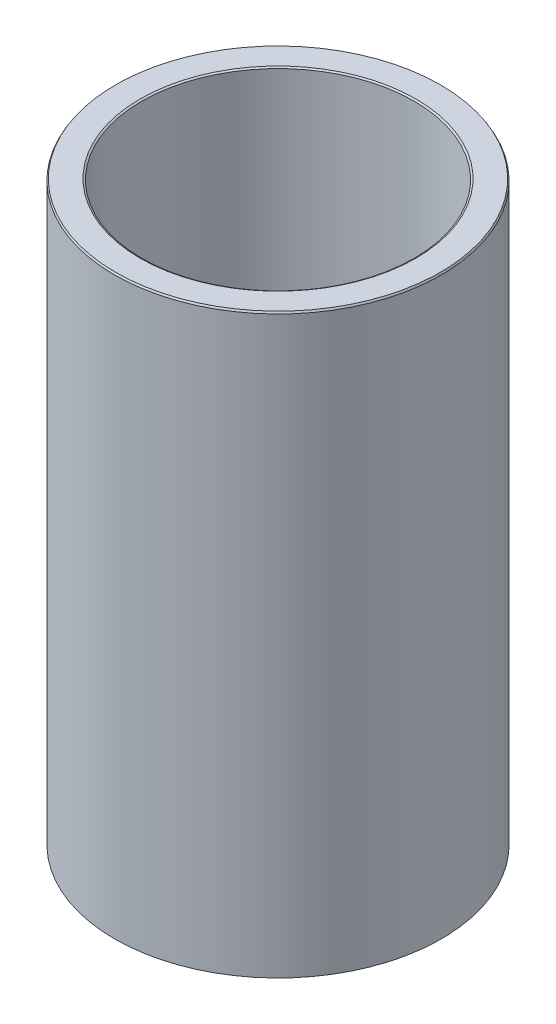
ISO-10303-21;
HEADER;
FILE_DESCRIPTION(('STEP AP214'),'2;1');
FILE_NAME('part.step','',(''),(''),'','','');
FILE_SCHEMA(('AUTOMOTIVE_DESIGN { 1 0 10303 214 1 1 1 1 }'));
ENDSEC;
DATA;
#1=APPLICATION_CONTEXT('core data for automotive mechanical design processes');
#2=APPLICATION_PROTOCOL_DEFINITION('international standard','automotive_design',2000,#1);
#3=PRODUCT_CONTEXT('',#1,'mechanical');
#4=PRODUCT('Part','Part','',(#3));
#5=PRODUCT_RELATED_PRODUCT_CATEGORY('part','',(#4));
#6=PRODUCT_DEFINITION_FORMATION('','',#4);
#7=PRODUCT_DEFINITION_CONTEXT('part definition',#1,'design');
#8=PRODUCT_DEFINITION('design','',#6,#7);
#9=PRODUCT_DEFINITION_SHAPE('','',#8);
#10=(LENGTH_UNIT() NAMED_UNIT(*) SI_UNIT(.MILLI.,.METRE.));
#11=(NAMED_UNIT(*) PLANE_ANGLE_UNIT() SI_UNIT($,.RADIAN.));
#12=(NAMED_UNIT(*) SI_UNIT($,.STERADIAN.) SOLID_ANGLE_UNIT());
#13=UNCERTAINTY_MEASURE_WITH_UNIT(LENGTH_MEASURE(1.E-05),#10,'distance_accuracy_value','');
#14=(GEOMETRIC_REPRESENTATION_CONTEXT(3) GLOBAL_UNCERTAINTY_ASSIGNED_CONTEXT((#13)) GLOBAL_UNIT_ASSIGNED_CONTEXT((#10,
#11,#12)) REPRESENTATION_CONTEXT('',''));
#15=CARTESIAN_POINT('',(0.,0.,0.));
#16=DIRECTION('',(0.,0.,1.));
#17=DIRECTION('',(1.,0.,0.));
#18=AXIS2_PLACEMENT_3D('',#15,#16,#17);
#19=CARTESIAN_POINT('',(0.,159.111934385555,0.));
#20=DIRECTION('',(0.,-1.,0.));
#21=DIRECTION('',(0.,0.,-1.));
#22=AXIS2_PLACEMENT_3D('',#19,#20,#21);
#23=CYLINDRICAL_SURFACE('',#22,45.);
#24=CARTESIAN_POINT('',(0.,0.278200347624352,0.));
#25=DIRECTION('',(0.,1.,0.));
#26=DIRECTION('',(0.,0.,1.));
#27=AXIS2_PLACEMENT_3D('',#24,#25,#26);
#28=CIRCLE('',#27,45.);
#29=CARTESIAN_POINT('',(0.,0.278200347624352,45.));
#30=VERTEX_POINT('',#29);
#31=EDGE_CURVE('E10',#30,#30,#28,.T.);
#32=ORIENTED_EDGE('',*,*,#31,.T.);
#33=EDGE_LOOP('',(#32));
#34=FACE_BOUND('',#33,.T.);
#35=CARTESIAN_POINT('',(0.,158.630077248787,0.));
#36=DIRECTION('',(0.,1.,0.));
#37=DIRECTION('',(0.,0.,1.));
#38=AXIS2_PLACEMENT_3D('',#35,#36,#37);
#39=CIRCLE('',#38,45.);
#40=CARTESIAN_POINT('',(0.,158.630077248787,45.));
#41=VERTEX_POINT('',#40);
#42=EDGE_CURVE('E50',#41,#41,#39,.F.);
#43=ORIENTED_EDGE('',*,*,#42,.T.);
#44=EDGE_LOOP('',(#43));
#45=FACE_BOUND('',#44,.T.);
#46=ADVANCED_FACE('F39',(#34,#45),#23,.T.);
#47=CARTESIAN_POINT('',(0.,159.111934385555,0.));
#48=DIRECTION('',(0.,1.,0.));
#49=DIRECTION('',(0.,0.,1.));
#50=AXIS2_PLACEMENT_3D('',#47,#48,#49);
#51=PLANE('',#50);
#52=CARTESIAN_POINT('',(0.,159.111934385555,0.));
#53=DIRECTION('',(0.,1.,0.));
#54=DIRECTION('',(0.,0.,1.));
#55=AXIS2_PLACEMENT_3D('',#52,#53,#54);
#56=CIRCLE('',#55,37.9807267890938);
#57=CARTESIAN_POINT('',(0.,159.111934385555,37.9807267890938));
#58=VERTEX_POINT('',#57);
#59=EDGE_CURVE('E58',#58,#58,#56,.F.);
#60=ORIENTED_EDGE('',*,*,#59,.T.);
#61=EDGE_LOOP('',(#60));
#62=FACE_BOUND('',#61,.T.);
#63=CARTESIAN_POINT('',(0.,159.111934385555,0.));
#64=DIRECTION('',(0.,1.,0.));
#65=DIRECTION('',(0.,0.,1.));
#66=AXIS2_PLACEMENT_3D('',#63,#64,#65);
#67=CIRCLE('',#66,44.7217996523756);
#68=CARTESIAN_POINT('',(0.,159.111934385555,44.7217996523756));
#69=VERTEX_POINT('',#68);
#70=EDGE_CURVE('E61',#69,#69,#67,.T.);
#71=ORIENTED_EDGE('',*,*,#70,.T.);
#72=EDGE_LOOP('',(#71));
#73=FACE_BOUND('',#72,.T.);
#74=ADVANCED_FACE('F88',(#62,#73),#51,.T.);
#75=CARTESIAN_POINT('',(0.,0.,0.));
#76=DIRECTION('',(0.,1.,0.));
#77=DIRECTION('',(0.,0.,1.));
#78=AXIS2_PLACEMENT_3D('',#75,#76,#77);
#79=PLANE('',#78);
#80=CARTESIAN_POINT('',(0.,0.,0.));
#81=DIRECTION('',(0.,1.,0.));
#82=DIRECTION('',(0.,0.,1.));
#83=AXIS2_PLACEMENT_3D('',#80,#81,#82);
#84=CIRCLE('',#83,37.7770699999494);
#85=CARTESIAN_POINT('',(0.,0.,37.7770699999494));
#86=VERTEX_POINT('',#85);
#87=EDGE_CURVE('E51',#86,#86,#84,.T.);
#88=ORIENTED_EDGE('',*,*,#87,.T.);
#89=EDGE_LOOP('',(#88));
#90=FACE_BOUND('',#89,.T.);
#91=CARTESIAN_POINT('',(0.,0.,0.));
#92=DIRECTION('',(0.,1.,0.));
#93=DIRECTION('',(0.,0.,1.));
#94=AXIS2_PLACEMENT_3D('',#91,#92,#93);
#95=CIRCLE('',#94,44.5181428632313);
#96=CARTESIAN_POINT('',(0.,0.,44.5181428632313));
#97=VERTEX_POINT('',#96);
#98=EDGE_CURVE('E54',#97,#97,#95,.F.);
#99=ORIENTED_EDGE('',*,*,#98,.T.);
#100=EDGE_LOOP('',(#99));
#101=FACE_BOUND('',#100,.T.);
#102=ADVANCED_FACE('F83',(#90,#101),#79,.F.);
#103=CARTESIAN_POINT('',(0.,159.111934385555,0.));
#104=DIRECTION('',(0.,-1.,0.));
#105=DIRECTION('',(0.,0.,-1.));
#106=AXIS2_PLACEMENT_3D('',#103,#104,#105);
#107=CYLINDRICAL_SURFACE('',#106,37.498869652325);
#108=CARTESIAN_POINT('',(0.,158.833734037931,0.));
#109=DIRECTION('',(0.,1.,0.));
#110=DIRECTION('',(0.,0.,1.));
#111=AXIS2_PLACEMENT_3D('',#108,#109,#110);
#112=CIRCLE('',#111,37.498869652325);
#113=CARTESIAN_POINT('',(0.,158.833734037931,37.498869652325));
#114=VERTEX_POINT('',#113);
#115=EDGE_CURVE('E67',#114,#114,#112,.T.);
#116=ORIENTED_EDGE('',*,*,#115,.T.);
#117=EDGE_LOOP('',(#116));
#118=FACE_BOUND('',#117,.T.);
#119=CARTESIAN_POINT('',(0.,0.48185713676871,0.));
#120=DIRECTION('',(0.,1.,0.));
#121=DIRECTION('',(0.,0.,1.));
#122=AXIS2_PLACEMENT_3D('',#119,#120,#121);
#123=CIRCLE('',#122,37.498869652325);
#124=CARTESIAN_POINT('',(0.,0.48185713676871,37.498869652325));
#125=VERTEX_POINT('',#124);
#126=EDGE_CURVE('E69',#125,#125,#123,.F.);
#127=ORIENTED_EDGE('',*,*,#126,.T.);
#128=EDGE_LOOP('',(#127));
#129=FACE_BOUND('',#128,.T.);
#130=ADVANCED_FACE('F71',(#118,#129),#107,.F.);
#131=CARTESIAN_POINT('',(0.,158.833734037931,0.));
#132=DIRECTION('',(0.,1.,0.));
#133=DIRECTION('',(0.,0.,1.));
#134=AXIS2_PLACEMENT_3D('',#131,#132,#133);
#135=CONICAL_SURFACE('',#134,37.498869652325,1.04719755119661);
#136=ORIENTED_EDGE('',*,*,#59,.F.);
#137=EDGE_LOOP('',(#136));
#138=FACE_BOUND('',#137,.T.);
#139=ORIENTED_EDGE('',*,*,#115,.F.);
#140=EDGE_LOOP('',(#139));
#141=FACE_BOUND('',#140,.T.);
#142=ADVANCED_FACE('F77',(#138,#141),#135,.F.);
#143=CARTESIAN_POINT('',(0.,0.,0.));
#144=DIRECTION('',(0.,-1.,0.));
#145=DIRECTION('',(0.,0.,-1.));
#146=AXIS2_PLACEMENT_3D('',#143,#144,#145);
#147=CONICAL_SURFACE('',#146,37.7770699999494,0.523598775598292);
#148=ORIENTED_EDGE('',*,*,#126,.F.);
#149=EDGE_LOOP('',(#148));
#150=FACE_BOUND('',#149,.T.);
#151=ORIENTED_EDGE('',*,*,#87,.F.);
#152=EDGE_LOOP('',(#151));
#153=FACE_BOUND('',#152,.T.);
#154=ADVANCED_FACE('F73',(#150,#153),#147,.F.);
#155=CARTESIAN_POINT('',(0.,0.278200347624352,0.));
#156=DIRECTION('',(0.,1.,0.));
#157=DIRECTION('',(0.,0.,1.));
#158=AXIS2_PLACEMENT_3D('',#155,#156,#157);
#159=CONICAL_SURFACE('',#158,45.,1.0471975511966);
#160=ORIENTED_EDGE('',*,*,#98,.F.);
#161=EDGE_LOOP('',(#160));
#162=FACE_BOUND('',#161,.T.);
#163=ORIENTED_EDGE('',*,*,#31,.F.);
#164=EDGE_LOOP('',(#163));
#165=FACE_BOUND('',#164,.T.);
#166=ADVANCED_FACE('F76',(#162,#165),#159,.T.);
#167=CARTESIAN_POINT('',(0.,159.111934385555,0.));
#168=DIRECTION('',(0.,-1.,0.));
#169=DIRECTION('',(0.,0.,-1.));
#170=AXIS2_PLACEMENT_3D('',#167,#168,#169);
#171=CONICAL_SURFACE('',#170,44.7217996523756,0.523598775598277);
#172=ORIENTED_EDGE('',*,*,#42,.F.);
#173=EDGE_LOOP('',(#172));
#174=FACE_BOUND('',#173,.T.);
#175=ORIENTED_EDGE('',*,*,#70,.F.);
#176=EDGE_LOOP('',(#175));
#177=FACE_BOUND('',#176,.T.);
#178=ADVANCED_FACE('F45',(#174,#177),#171,.T.);
#179=CLOSED_SHELL('',(#46,#74,#102,#130,#142,#154,#166,#178));
#180=MANIFOLD_SOLID_BREP('B2',#179);
#181=ADVANCED_BREP_SHAPE_REPRESENTATION('',(#18,#180),#14);
#182=SHAPE_DEFINITION_REPRESENTATION(#9,#181);
ENDSEC;
END-ISO-10303-21;
